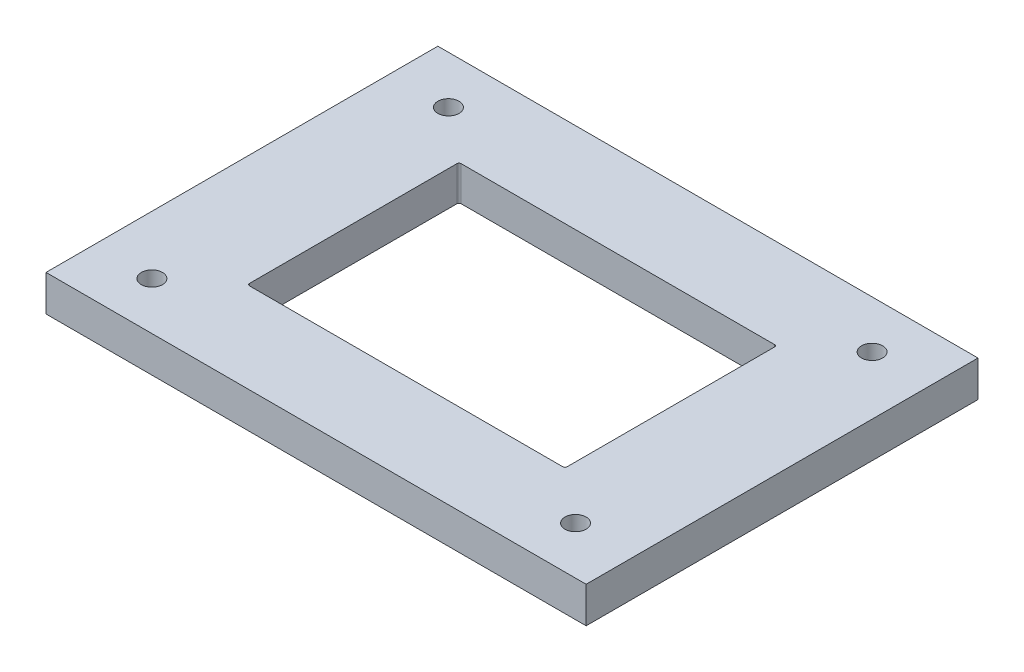
ISO-10303-21;
HEADER;
FILE_DESCRIPTION(('STEP AP214'),'2;1');
FILE_NAME('part.step','',(''),(''),'','','');
FILE_SCHEMA(('AUTOMOTIVE_DESIGN { 1 0 10303 214 1 1 1 1 }'));
ENDSEC;
DATA;
#1=APPLICATION_CONTEXT('core data for automotive mechanical design processes');
#2=APPLICATION_PROTOCOL_DEFINITION('international standard','automotive_design',2000,#1);
#3=PRODUCT_CONTEXT('',#1,'mechanical');
#4=PRODUCT('Part','Part','',(#3));
#5=PRODUCT_RELATED_PRODUCT_CATEGORY('part','',(#4));
#6=PRODUCT_DEFINITION_FORMATION('','',#4);
#7=PRODUCT_DEFINITION_CONTEXT('part definition',#1,'design');
#8=PRODUCT_DEFINITION('design','',#6,#7);
#9=PRODUCT_DEFINITION_SHAPE('','',#8);
#10=(LENGTH_UNIT() NAMED_UNIT(*) SI_UNIT(.MILLI.,.METRE.));
#11=(NAMED_UNIT(*) PLANE_ANGLE_UNIT() SI_UNIT($,.RADIAN.));
#12=(NAMED_UNIT(*) SI_UNIT($,.STERADIAN.) SOLID_ANGLE_UNIT());
#13=UNCERTAINTY_MEASURE_WITH_UNIT(LENGTH_MEASURE(1.E-05),#10,'distance_accuracy_value','');
#14=(GEOMETRIC_REPRESENTATION_CONTEXT(3) GLOBAL_UNCERTAINTY_ASSIGNED_CONTEXT((#13)) GLOBAL_UNIT_ASSIGNED_CONTEXT((#10,
#11,#12)) REPRESENTATION_CONTEXT('',''));
#15=CARTESIAN_POINT('',(0.,0.,0.));
#16=DIRECTION('',(0.,0.,1.));
#17=DIRECTION('',(1.,0.,0.));
#18=AXIS2_PLACEMENT_3D('',#15,#16,#17);
#19=CARTESIAN_POINT('',(-127.5,-17.,92.5));
#20=DIRECTION('',(-1.,0.,0.));
#21=DIRECTION('',(0.,0.,1.));
#22=AXIS2_PLACEMENT_3D('',#19,#20,#21);
#23=PLANE('',#22);
#24=DIRECTION('',(0.,0.,1.));
#25=VECTOR('',#24,1.);
#26=CARTESIAN_POINT('',(-127.5,0.,92.5));
#27=LINE('',#26,#25);
#28=CARTESIAN_POINT('',(-127.5,0.,-92.5));
#29=VERTEX_POINT('',#28);
#30=CARTESIAN_POINT('',(-127.5,0.,92.5));
#31=VERTEX_POINT('',#30);
#32=EDGE_CURVE('E158',#29,#31,#27,.T.);
#33=ORIENTED_EDGE('',*,*,#32,.F.);
#34=DIRECTION('',(0.,1.,0.));
#35=VECTOR('',#34,1.);
#36=CARTESIAN_POINT('',(-127.5,-17.,-92.5));
#37=LINE('',#36,#35);
#38=CARTESIAN_POINT('',(-127.5,-17.,-92.5));
#39=VERTEX_POINT('',#38);
#40=EDGE_CURVE('E146',#39,#29,#37,.T.);
#41=ORIENTED_EDGE('',*,*,#40,.F.);
#42=DIRECTION('',(0.,0.,1.));
#43=VECTOR('',#42,1.);
#44=CARTESIAN_POINT('',(-127.5,-17.,92.5));
#45=LINE('',#44,#43);
#46=CARTESIAN_POINT('',(-127.5,-17.,92.5));
#47=VERTEX_POINT('',#46);
#48=EDGE_CURVE('E141',#39,#47,#45,.T.);
#49=ORIENTED_EDGE('',*,*,#48,.T.);
#50=DIRECTION('',(0.,1.,0.));
#51=VECTOR('',#50,1.);
#52=CARTESIAN_POINT('',(-127.5,-17.,92.5));
#53=LINE('',#52,#51);
#54=EDGE_CURVE('E123',#47,#31,#53,.T.);
#55=ORIENTED_EDGE('',*,*,#54,.T.);
#56=EDGE_LOOP('',(#33,#41,#49,#55));
#57=FACE_BOUND('',#56,.T.);
#58=ADVANCED_FACE('F33',(#57),#23,.T.);
#59=CARTESIAN_POINT('',(127.5,-17.,-92.5));
#60=DIRECTION('',(0.,0.,-1.));
#61=DIRECTION('',(-1.,0.,0.));
#62=AXIS2_PLACEMENT_3D('',#59,#60,#61);
#63=PLANE('',#62);
#64=DIRECTION('',(-1.,0.,0.));
#65=VECTOR('',#64,1.);
#66=CARTESIAN_POINT('',(127.5,0.,-92.5));
#67=LINE('',#66,#65);
#68=CARTESIAN_POINT('',(127.5,0.,-92.5));
#69=VERTEX_POINT('',#68);
#70=EDGE_CURVE('E147',#69,#29,#67,.T.);
#71=ORIENTED_EDGE('',*,*,#70,.F.);
#72=DIRECTION('',(0.,1.,0.));
#73=VECTOR('',#72,1.);
#74=CARTESIAN_POINT('',(127.5,-17.,-92.5));
#75=LINE('',#74,#73);
#76=CARTESIAN_POINT('',(127.5,-17.,-92.5));
#77=VERTEX_POINT('',#76);
#78=EDGE_CURVE('E165',#77,#69,#75,.T.);
#79=ORIENTED_EDGE('',*,*,#78,.F.);
#80=DIRECTION('',(-1.,0.,0.));
#81=VECTOR('',#80,1.);
#82=CARTESIAN_POINT('',(127.5,-17.,-92.5));
#83=LINE('',#82,#81);
#84=EDGE_CURVE('E134',#77,#39,#83,.T.);
#85=ORIENTED_EDGE('',*,*,#84,.T.);
#86=ORIENTED_EDGE('',*,*,#40,.T.);
#87=EDGE_LOOP('',(#71,#79,#85,#86));
#88=FACE_BOUND('',#87,.T.);
#89=ADVANCED_FACE('F281',(#88),#63,.T.);
#90=CARTESIAN_POINT('',(127.5,-17.,92.5));
#91=DIRECTION('',(1.,0.,0.));
#92=DIRECTION('',(0.,0.,-1.));
#93=AXIS2_PLACEMENT_3D('',#90,#91,#92);
#94=PLANE('',#93);
#95=DIRECTION('',(0.,0.,-1.));
#96=VECTOR('',#95,1.);
#97=CARTESIAN_POINT('',(127.5,0.,92.5));
#98=LINE('',#97,#96);
#99=CARTESIAN_POINT('',(127.5,0.,92.5));
#100=VERTEX_POINT('',#99);
#101=EDGE_CURVE('E150',#100,#69,#98,.T.);
#102=ORIENTED_EDGE('',*,*,#101,.F.);
#103=DIRECTION('',(0.,1.,0.));
#104=VECTOR('',#103,1.);
#105=CARTESIAN_POINT('',(127.5,-17.,92.5));
#106=LINE('',#105,#104);
#107=CARTESIAN_POINT('',(127.5,-17.,92.5));
#108=VERTEX_POINT('',#107);
#109=EDGE_CURVE('E133',#108,#100,#106,.T.);
#110=ORIENTED_EDGE('',*,*,#109,.F.);
#111=DIRECTION('',(0.,0.,-1.));
#112=VECTOR('',#111,1.);
#113=CARTESIAN_POINT('',(127.5,-17.,92.5));
#114=LINE('',#113,#112);
#115=EDGE_CURVE('E144',#108,#77,#114,.T.);
#116=ORIENTED_EDGE('',*,*,#115,.T.);
#117=ORIENTED_EDGE('',*,*,#78,.T.);
#118=EDGE_LOOP('',(#102,#110,#116,#117));
#119=FACE_BOUND('',#118,.T.);
#120=ADVANCED_FACE('F276',(#119),#94,.T.);
#121=CARTESIAN_POINT('',(127.5,-17.,92.5));
#122=DIRECTION('',(0.,0.,1.));
#123=DIRECTION('',(1.,0.,0.));
#124=AXIS2_PLACEMENT_3D('',#121,#122,#123);
#125=PLANE('',#124);
#126=DIRECTION('',(1.,0.,0.));
#127=VECTOR('',#126,1.);
#128=CARTESIAN_POINT('',(127.5,0.,92.5));
#129=LINE('',#128,#127);
#130=EDGE_CURVE('E128',#31,#100,#129,.T.);
#131=ORIENTED_EDGE('',*,*,#130,.F.);
#132=ORIENTED_EDGE('',*,*,#54,.F.);
#133=DIRECTION('',(1.,0.,0.));
#134=VECTOR('',#133,1.);
#135=CARTESIAN_POINT('',(127.5,-17.,92.5));
#136=LINE('',#135,#134);
#137=EDGE_CURVE('E126',#47,#108,#136,.T.);
#138=ORIENTED_EDGE('',*,*,#137,.T.);
#139=ORIENTED_EDGE('',*,*,#109,.T.);
#140=EDGE_LOOP('',(#131,#132,#138,#139));
#141=FACE_BOUND('',#140,.T.);
#142=ADVANCED_FACE('F125',(#141),#125,.T.);
#143=CARTESIAN_POINT('',(0.,-17.,0.));
#144=DIRECTION('',(0.,1.,0.));
#145=DIRECTION('',(0.,0.,1.));
#146=AXIS2_PLACEMENT_3D('',#143,#144,#145);
#147=PLANE('',#146);
#148=CARTESIAN_POINT('',(-100.,-17.,70.));
#149=DIRECTION('',(0.,1.,0.));
#150=DIRECTION('',(0.,0.,1.));
#151=AXIS2_PLACEMENT_3D('',#148,#149,#150);
#152=CIRCLE('',#151,5.00000000000001);
#153=CARTESIAN_POINT('',(-100.,-17.,75.));
#154=VERTEX_POINT('',#153);
#155=EDGE_CURVE('E230',#154,#154,#152,.T.);
#156=ORIENTED_EDGE('',*,*,#155,.T.);
#157=EDGE_LOOP('',(#156));
#158=FACE_BOUND('',#157,.T.);
#159=CARTESIAN_POINT('',(100.,-17.,70.));
#160=DIRECTION('',(0.,1.,0.));
#161=DIRECTION('',(0.,0.,1.));
#162=AXIS2_PLACEMENT_3D('',#159,#160,#161);
#163=CIRCLE('',#162,5.00000000000001);
#164=CARTESIAN_POINT('',(100.,-17.,75.));
#165=VERTEX_POINT('',#164);
#166=EDGE_CURVE('E233',#165,#165,#163,.T.);
#167=ORIENTED_EDGE('',*,*,#166,.T.);
#168=EDGE_LOOP('',(#167));
#169=FACE_BOUND('',#168,.T.);
#170=CARTESIAN_POINT('',(100.,-17.,-70.));
#171=DIRECTION('',(0.,1.,0.));
#172=DIRECTION('',(0.,0.,1.));
#173=AXIS2_PLACEMENT_3D('',#170,#171,#172);
#174=CIRCLE('',#173,5.00000000000001);
#175=CARTESIAN_POINT('',(100.,-17.,-65.));
#176=VERTEX_POINT('',#175);
#177=EDGE_CURVE('E236',#176,#176,#174,.T.);
#178=ORIENTED_EDGE('',*,*,#177,.T.);
#179=EDGE_LOOP('',(#178));
#180=FACE_BOUND('',#179,.T.);
#181=CARTESIAN_POINT('',(-100.,-17.,-70.));
#182=DIRECTION('',(0.,1.,0.));
#183=DIRECTION('',(0.,0.,1.));
#184=AXIS2_PLACEMENT_3D('',#181,#182,#183);
#185=CIRCLE('',#184,5.00000000000001);
#186=CARTESIAN_POINT('',(-100.,-17.,-65.));
#187=VERTEX_POINT('',#186);
#188=EDGE_CURVE('E239',#187,#187,#185,.T.);
#189=ORIENTED_EDGE('',*,*,#188,.T.);
#190=EDGE_LOOP('',(#189));
#191=FACE_BOUND('',#190,.T.);
#192=DIRECTION('',(0.,0.,-1.));
#193=VECTOR('',#192,1.);
#194=CARTESIAN_POINT('',(75.5636530813597,-17.,0.));
#195=LINE('',#194,#193);
#196=CARTESIAN_POINT('',(75.5636530813597,-17.,49.5642622543406));
#197=VERTEX_POINT('',#196);
#198=CARTESIAN_POINT('',(75.5636530813597,-17.,-49.5642622543406));
#199=VERTEX_POINT('',#198);
#200=EDGE_CURVE('E219',#197,#199,#195,.T.);
#201=ORIENTED_EDGE('',*,*,#200,.T.);
#202=CARTESIAN_POINT('',(74.5630435370609,-17.,-49.5630435370609));
#203=DIRECTION('',(0.,1.,0.));
#204=DIRECTION('',(0.707106781186548,0.,-0.707106781186548));
#205=AXIS2_PLACEMENT_3D('',#202,#203,#204);
#206=ELLIPSE('',#205,1.00121871750572,1.);
#207=CARTESIAN_POINT('',(74.5642622543406,-17.,-50.5636530813597));
#208=VERTEX_POINT('',#207);
#209=EDGE_CURVE('E55',#199,#208,#206,.T.);
#210=ORIENTED_EDGE('',*,*,#209,.T.);
#211=DIRECTION('',(-1.,0.,0.));
#212=VECTOR('',#211,1.);
#213=CARTESIAN_POINT('',(0.,-17.,-50.5636530813597));
#214=LINE('',#213,#212);
#215=CARTESIAN_POINT('',(-74.5642622543406,-17.,-50.5636530813597));
#216=VERTEX_POINT('',#215);
#217=EDGE_CURVE('E215',#208,#216,#214,.T.);
#218=ORIENTED_EDGE('',*,*,#217,.T.);
#219=CARTESIAN_POINT('',(-74.5630435370609,-17.,-49.5630435370609));
#220=DIRECTION('',(0.,1.,0.));
#221=DIRECTION('',(-0.707106781186548,0.,-0.707106781186548));
#222=AXIS2_PLACEMENT_3D('',#219,#220,#221);
#223=ELLIPSE('',#222,1.00121871750572,1.);
#224=CARTESIAN_POINT('',(-75.5636530813597,-17.,-49.5642622543406));
#225=VERTEX_POINT('',#224);
#226=EDGE_CURVE('E11',#216,#225,#223,.T.);
#227=ORIENTED_EDGE('',*,*,#226,.T.);
#228=DIRECTION('',(0.,0.,1.));
#229=VECTOR('',#228,1.);
#230=CARTESIAN_POINT('',(-75.5636530813597,-17.,0.));
#231=LINE('',#230,#229);
#232=CARTESIAN_POINT('',(-75.5636530813597,-17.,49.5642622543406));
#233=VERTEX_POINT('',#232);
#234=EDGE_CURVE('E153',#225,#233,#231,.T.);
#235=ORIENTED_EDGE('',*,*,#234,.T.);
#236=CARTESIAN_POINT('',(-74.5630435370609,-17.,49.5630435370609));
#237=DIRECTION('',(0.,1.,0.));
#238=DIRECTION('',(-0.707106781186548,0.,0.707106781186548));
#239=AXIS2_PLACEMENT_3D('',#236,#237,#238);
#240=ELLIPSE('',#239,1.00121871750572,1.);
#241=CARTESIAN_POINT('',(-74.5642622543406,-17.,50.5636530813597));
#242=VERTEX_POINT('',#241);
#243=EDGE_CURVE('E192',#233,#242,#240,.T.);
#244=ORIENTED_EDGE('',*,*,#243,.T.);
#245=DIRECTION('',(1.,0.,0.));
#246=VECTOR('',#245,1.);
#247=CARTESIAN_POINT('',(0.,-17.,50.5636530813597));
#248=LINE('',#247,#246);
#249=CARTESIAN_POINT('',(74.5642622543406,-17.,50.5636530813597));
#250=VERTEX_POINT('',#249);
#251=EDGE_CURVE('E208',#242,#250,#248,.T.);
#252=ORIENTED_EDGE('',*,*,#251,.T.);
#253=CARTESIAN_POINT('',(74.5630435370609,-17.,49.5630435370609));
#254=DIRECTION('',(0.,1.,0.));
#255=DIRECTION('',(0.707106781186548,0.,0.707106781186548));
#256=AXIS2_PLACEMENT_3D('',#253,#254,#255);
#257=ELLIPSE('',#256,1.00121871750572,1.);
#258=EDGE_CURVE('E188',#250,#197,#257,.T.);
#259=ORIENTED_EDGE('',*,*,#258,.T.);
#260=EDGE_LOOP('',(#201,#210,#218,#227,#235,#244,#252,#259));
#261=FACE_BOUND('',#260,.T.);
#262=ORIENTED_EDGE('',*,*,#48,.F.);
#263=ORIENTED_EDGE('',*,*,#84,.F.);
#264=ORIENTED_EDGE('',*,*,#115,.F.);
#265=ORIENTED_EDGE('',*,*,#137,.F.);
#266=EDGE_LOOP('',(#262,#263,#264,#265));
#267=FACE_BOUND('',#266,.T.);
#268=ADVANCED_FACE('F139',(#158,#169,#180,#191,#261,#267),#147,.F.);
#269=CARTESIAN_POINT('',(0.,0.,0.));
#270=DIRECTION('',(0.,1.,0.));
#271=DIRECTION('',(0.,0.,1.));
#272=AXIS2_PLACEMENT_3D('',#269,#270,#271);
#273=PLANE('',#272);
#274=CARTESIAN_POINT('',(-100.,0.,70.));
#275=DIRECTION('',(0.,1.,0.));
#276=DIRECTION('',(0.,0.,-1.));
#277=AXIS2_PLACEMENT_3D('',#274,#275,#276);
#278=CIRCLE('',#277,5.00000000000001);
#279=CARTESIAN_POINT('',(-100.,0.,65.));
#280=VERTEX_POINT('',#279);
#281=EDGE_CURVE('E246',#280,#280,#278,.T.);
#282=ORIENTED_EDGE('',*,*,#281,.F.);
#283=EDGE_LOOP('',(#282));
#284=FACE_BOUND('',#283,.T.);
#285=CARTESIAN_POINT('',(100.,0.,70.));
#286=DIRECTION('',(0.,1.,0.));
#287=DIRECTION('',(0.,0.,1.));
#288=AXIS2_PLACEMENT_3D('',#285,#286,#287);
#289=CIRCLE('',#288,5.00000000000001);
#290=CARTESIAN_POINT('',(100.,0.,75.));
#291=VERTEX_POINT('',#290);
#292=EDGE_CURVE('E249',#291,#291,#289,.T.);
#293=ORIENTED_EDGE('',*,*,#292,.F.);
#294=EDGE_LOOP('',(#293));
#295=FACE_BOUND('',#294,.T.);
#296=CARTESIAN_POINT('',(100.,0.,-70.));
#297=DIRECTION('',(0.,1.,0.));
#298=DIRECTION('',(0.,0.,-1.));
#299=AXIS2_PLACEMENT_3D('',#296,#297,#298);
#300=CIRCLE('',#299,5.00000000000001);
#301=CARTESIAN_POINT('',(100.,0.,-75.));
#302=VERTEX_POINT('',#301);
#303=EDGE_CURVE('E245',#302,#302,#300,.T.);
#304=ORIENTED_EDGE('',*,*,#303,.F.);
#305=EDGE_LOOP('',(#304));
#306=FACE_BOUND('',#305,.T.);
#307=CARTESIAN_POINT('',(-100.,0.,-70.));
#308=DIRECTION('',(0.,1.,0.));
#309=DIRECTION('',(0.,0.,1.));
#310=AXIS2_PLACEMENT_3D('',#307,#308,#309);
#311=CIRCLE('',#310,5.00000000000001);
#312=CARTESIAN_POINT('',(-100.,0.,-65.));
#313=VERTEX_POINT('',#312);
#314=EDGE_CURVE('E242',#313,#313,#311,.T.);
#315=ORIENTED_EDGE('',*,*,#314,.F.);
#316=EDGE_LOOP('',(#315));
#317=FACE_BOUND('',#316,.T.);
#318=DIRECTION('',(0.,0.,1.));
#319=VECTOR('',#318,1.);
#320=CARTESIAN_POINT('',(-74.97,0.,49.97));
#321=LINE('',#320,#319);
#322=CARTESIAN_POINT('',(-74.97,0.,-48.9706091729809));
#323=VERTEX_POINT('',#322);
#324=CARTESIAN_POINT('',(-74.97,0.,48.9706091729809));
#325=VERTEX_POINT('',#324);
#326=EDGE_CURVE('E203',#323,#325,#321,.T.);
#327=ORIENTED_EDGE('',*,*,#326,.F.);
#328=CARTESIAN_POINT('',(-73.9693904557012,0.,-48.9693904557012));
#329=DIRECTION('',(0.,1.,0.));
#330=DIRECTION('',(-0.707106781186548,0.,-0.707106781186548));
#331=AXIS2_PLACEMENT_3D('',#328,#329,#330);
#332=ELLIPSE('',#331,1.00121871750572,1.);
#333=CARTESIAN_POINT('',(-73.9706091729809,0.,-49.97));
#334=VERTEX_POINT('',#333);
#335=EDGE_CURVE('E41',#323,#334,#332,.F.);
#336=ORIENTED_EDGE('',*,*,#335,.T.);
#337=DIRECTION('',(-1.,0.,0.));
#338=VECTOR('',#337,1.);
#339=CARTESIAN_POINT('',(74.97,0.,-49.97));
#340=LINE('',#339,#338);
#341=CARTESIAN_POINT('',(73.9706091729809,0.,-49.97));
#342=VERTEX_POINT('',#341);
#343=EDGE_CURVE('E201',#342,#334,#340,.T.);
#344=ORIENTED_EDGE('',*,*,#343,.F.);
#345=CARTESIAN_POINT('',(73.9693904557012,0.,-48.9693904557012));
#346=DIRECTION('',(0.,1.,0.));
#347=DIRECTION('',(0.707106781186548,0.,-0.707106781186548));
#348=AXIS2_PLACEMENT_3D('',#345,#346,#347);
#349=ELLIPSE('',#348,1.00121871750572,1.);
#350=CARTESIAN_POINT('',(74.97,0.,-48.9706091729809));
#351=VERTEX_POINT('',#350);
#352=EDGE_CURVE('E194',#342,#351,#349,.F.);
#353=ORIENTED_EDGE('',*,*,#352,.T.);
#354=DIRECTION('',(0.,0.,-1.));
#355=VECTOR('',#354,1.);
#356=CARTESIAN_POINT('',(74.97,0.,49.97));
#357=LINE('',#356,#355);
#358=CARTESIAN_POINT('',(74.97,0.,48.9706091729809));
#359=VERTEX_POINT('',#358);
#360=EDGE_CURVE('E209',#359,#351,#357,.T.);
#361=ORIENTED_EDGE('',*,*,#360,.F.);
#362=CARTESIAN_POINT('',(73.9693904557012,0.,48.9693904557012));
#363=DIRECTION('',(0.,1.,0.));
#364=DIRECTION('',(0.707106781186548,0.,0.707106781186548));
#365=AXIS2_PLACEMENT_3D('',#362,#363,#364);
#366=ELLIPSE('',#365,1.00121871750572,1.);
#367=CARTESIAN_POINT('',(73.9706091729809,0.,49.97));
#368=VERTEX_POINT('',#367);
#369=EDGE_CURVE('E186',#359,#368,#366,.F.);
#370=ORIENTED_EDGE('',*,*,#369,.T.);
#371=DIRECTION('',(1.,0.,0.));
#372=VECTOR('',#371,1.);
#373=CARTESIAN_POINT('',(74.97,0.,49.97));
#374=LINE('',#373,#372);
#375=CARTESIAN_POINT('',(-73.9706091729809,0.,49.97));
#376=VERTEX_POINT('',#375);
#377=EDGE_CURVE('E226',#376,#368,#374,.T.);
#378=ORIENTED_EDGE('',*,*,#377,.F.);
#379=CARTESIAN_POINT('',(-73.9693904557012,0.,48.9693904557012));
#380=DIRECTION('',(0.,1.,0.));
#381=DIRECTION('',(-0.707106781186548,0.,0.707106781186548));
#382=AXIS2_PLACEMENT_3D('',#379,#380,#381);
#383=ELLIPSE('',#382,1.00121871750572,1.);
#384=EDGE_CURVE('E190',#376,#325,#383,.F.);
#385=ORIENTED_EDGE('',*,*,#384,.T.);
#386=EDGE_LOOP('',(#327,#336,#344,#353,#361,#370,#378,#385));
#387=FACE_BOUND('',#386,.T.);
#388=ORIENTED_EDGE('',*,*,#32,.T.);
#389=ORIENTED_EDGE('',*,*,#130,.T.);
#390=ORIENTED_EDGE('',*,*,#101,.T.);
#391=ORIENTED_EDGE('',*,*,#70,.T.);
#392=EDGE_LOOP('',(#388,#389,#390,#391));
#393=FACE_BOUND('',#392,.T.);
#394=ADVANCED_FACE('F199',(#284,#295,#306,#317,#387,#393),#273,.T.);
#395=CARTESIAN_POINT('',(-74.97,0.,49.97));
#396=DIRECTION('',(-0.999390827019096,0.034899496702501,0.));
#397=DIRECTION('',(-0.034899496702501,-0.999390827019096,0.));
#398=AXIS2_PLACEMENT_3D('',#395,#396,#397);
#399=PLANE('',#398);
#400=ORIENTED_EDGE('',*,*,#326,.T.);
#401=DIRECTION('',(0.0348782627423747,0.998782765958718,-0.0348782627423747));
#402=VECTOR('',#401,1.);
#403=CARTESIAN_POINT('',(-75.5648688335168,-17.0348145867008,49.5654780064978));
#404=LINE('',#403,#402);
#405=EDGE_CURVE('E180',#325,#233,#404,.F.);
#406=ORIENTED_EDGE('',*,*,#405,.T.);
#407=ORIENTED_EDGE('',*,*,#234,.F.);
#408=DIRECTION('',(0.0348782627423747,0.998782765958718,0.0348782627423747));
#409=VECTOR('',#408,1.);
#410=CARTESIAN_POINT('',(-74.9712157521571,-0.0348145867008237,-48.971824925138));
#411=LINE('',#410,#409);
#412=EDGE_CURVE('E177',#225,#323,#411,.T.);
#413=ORIENTED_EDGE('',*,*,#412,.T.);
#414=EDGE_LOOP('',(#400,#406,#407,#413));
#415=FACE_BOUND('',#414,.T.);
#416=ADVANCED_FACE('F217',(#415),#399,.F.);
#417=CARTESIAN_POINT('',(74.97,0.,-49.97));
#418=DIRECTION('',(0.,0.034899496702501,-0.999390827019096));
#419=DIRECTION('',(0.,0.999390827019096,0.034899496702501));
#420=AXIS2_PLACEMENT_3D('',#417,#418,#419);
#421=PLANE('',#420);
#422=ORIENTED_EDGE('',*,*,#217,.F.);
#423=DIRECTION('',(-0.0348782627423747,0.998782765958718,0.0348782627423747));
#424=VECTOR('',#423,1.);
#425=CARTESIAN_POINT('',(73.971824925138,-0.0348145867008247,-49.9712157521571));
#426=LINE('',#425,#424);
#427=EDGE_CURVE('E183',#208,#342,#426,.T.);
#428=ORIENTED_EDGE('',*,*,#427,.T.);
#429=ORIENTED_EDGE('',*,*,#343,.T.);
#430=DIRECTION('',(0.0348782627423747,0.998782765958718,0.0348782627423747));
#431=VECTOR('',#430,1.);
#432=CARTESIAN_POINT('',(-74.5654780064977,-17.0348145867008,-50.5648688335168));
#433=LINE('',#432,#431);
#434=EDGE_CURVE('E48',#334,#216,#433,.F.);
#435=ORIENTED_EDGE('',*,*,#434,.T.);
#436=EDGE_LOOP('',(#422,#428,#429,#435));
#437=FACE_BOUND('',#436,.T.);
#438=ADVANCED_FACE('F206',(#437),#421,.F.);
#439=CARTESIAN_POINT('',(74.97,0.,49.97));
#440=DIRECTION('',(0.999390827019096,0.034899496702501,0.));
#441=DIRECTION('',(-0.034899496702501,0.999390827019096,0.));
#442=AXIS2_PLACEMENT_3D('',#439,#440,#441);
#443=PLANE('',#442);
#444=ORIENTED_EDGE('',*,*,#200,.F.);
#445=DIRECTION('',(-0.0348782627423747,0.998782765958718,-0.0348782627423747));
#446=VECTOR('',#445,1.);
#447=CARTESIAN_POINT('',(74.9712157521571,-0.0348145867008247,48.971824925138));
#448=LINE('',#447,#446);
#449=EDGE_CURVE('E169',#197,#359,#448,.T.);
#450=ORIENTED_EDGE('',*,*,#449,.T.);
#451=ORIENTED_EDGE('',*,*,#360,.T.);
#452=DIRECTION('',(-0.0348782627423747,0.998782765958718,0.0348782627423747));
#453=VECTOR('',#452,1.);
#454=CARTESIAN_POINT('',(75.5648688335168,-17.0348145867008,-49.5654780064977));
#455=LINE('',#454,#453);
#456=EDGE_CURVE('E164',#351,#199,#455,.F.);
#457=ORIENTED_EDGE('',*,*,#456,.T.);
#458=EDGE_LOOP('',(#444,#450,#451,#457));
#459=FACE_BOUND('',#458,.T.);
#460=ADVANCED_FACE('F308',(#459),#443,.F.);
#461=CARTESIAN_POINT('',(74.97,0.,49.97));
#462=DIRECTION('',(0.,0.034899496702501,0.999390827019096));
#463=DIRECTION('',(0.,-0.999390827019096,0.034899496702501));
#464=AXIS2_PLACEMENT_3D('',#461,#462,#463);
#465=PLANE('',#464);
#466=ORIENTED_EDGE('',*,*,#377,.T.);
#467=DIRECTION('',(-0.0348782627423747,0.998782765958718,-0.0348782627423747));
#468=VECTOR('',#467,1.);
#469=CARTESIAN_POINT('',(74.5654780064977,-17.0348145867008,50.5648688335168));
#470=LINE('',#469,#468);
#471=EDGE_CURVE('E175',#368,#250,#470,.F.);
#472=ORIENTED_EDGE('',*,*,#471,.T.);
#473=ORIENTED_EDGE('',*,*,#251,.F.);
#474=DIRECTION('',(0.0348782627423747,0.998782765958718,-0.0348782627423747));
#475=VECTOR('',#474,1.);
#476=CARTESIAN_POINT('',(-73.971824925138,-0.0348145867008233,49.9712157521571));
#477=LINE('',#476,#475);
#478=EDGE_CURVE('E172',#242,#376,#477,.T.);
#479=ORIENTED_EDGE('',*,*,#478,.T.);
#480=EDGE_LOOP('',(#466,#472,#473,#479));
#481=FACE_BOUND('',#480,.T.);
#482=ADVANCED_FACE('F294',(#481),#465,.F.);
#483=CARTESIAN_POINT('',(73.971824925138,-0.0697140834033256,48.971824925138));
#484=DIRECTION('',(0.0348782627423747,-0.998782765958718,0.0348782627423747));
#485=DIRECTION('',(0.,-0.034899496702501,-0.999390827019096));
#486=AXIS2_PLACEMENT_3D('',#483,#484,#485);
#487=CYLINDRICAL_SURFACE('',#486,1.);
#488=ORIENTED_EDGE('',*,*,#258,.F.);
#489=ORIENTED_EDGE('',*,*,#471,.F.);
#490=ORIENTED_EDGE('',*,*,#369,.F.);
#491=ORIENTED_EDGE('',*,*,#449,.F.);
#492=EDGE_LOOP('',(#488,#489,#490,#491));
#493=FACE_BOUND('',#492,.T.);
#494=ADVANCED_FACE('F290',(#493),#487,.F.);
#495=CARTESIAN_POINT('',(-73.7894239329418,5.15356692818224,48.7894239329418));
#496=DIRECTION('',(-0.0348782627423747,-0.998782765958718,0.0348782627423747));
#497=DIRECTION('',(0.,-0.034899496702501,-0.999390827019096));
#498=AXIS2_PLACEMENT_3D('',#495,#496,#497);
#499=CYLINDRICAL_SURFACE('',#498,1.);
#500=ORIENTED_EDGE('',*,*,#243,.F.);
#501=ORIENTED_EDGE('',*,*,#405,.F.);
#502=ORIENTED_EDGE('',*,*,#384,.F.);
#503=ORIENTED_EDGE('',*,*,#478,.F.);
#504=EDGE_LOOP('',(#500,#501,#502,#503));
#505=FACE_BOUND('',#504,.T.);
#506=ADVANCED_FACE('F293',(#505),#499,.F.);
#507=CARTESIAN_POINT('',(73.971824925138,-0.0697140834033256,-48.971824925138));
#508=DIRECTION('',(0.0348782627423747,-0.998782765958718,-0.0348782627423747));
#509=DIRECTION('',(0.,0.034899496702501,-0.999390827019096));
#510=AXIS2_PLACEMENT_3D('',#507,#508,#509);
#511=CYLINDRICAL_SURFACE('',#510,1.);
#512=ORIENTED_EDGE('',*,*,#209,.F.);
#513=ORIENTED_EDGE('',*,*,#456,.F.);
#514=ORIENTED_EDGE('',*,*,#352,.F.);
#515=ORIENTED_EDGE('',*,*,#427,.F.);
#516=EDGE_LOOP('',(#512,#513,#514,#515));
#517=FACE_BOUND('',#516,.T.);
#518=ADVANCED_FACE('F297',(#517),#511,.F.);
#519=CARTESIAN_POINT('',(-73.8502485935381,3.41177654149905,-48.8502485935381));
#520=DIRECTION('',(-0.0348782627423747,-0.998782765958718,-0.0348782627423747));
#521=DIRECTION('',(0.,0.034899496702501,-0.999390827019096));
#522=AXIS2_PLACEMENT_3D('',#519,#520,#521);
#523=CYLINDRICAL_SURFACE('',#522,1.);
#524=ORIENTED_EDGE('',*,*,#226,.F.);
#525=ORIENTED_EDGE('',*,*,#434,.F.);
#526=ORIENTED_EDGE('',*,*,#335,.F.);
#527=ORIENTED_EDGE('',*,*,#412,.F.);
#528=EDGE_LOOP('',(#524,#525,#526,#527));
#529=FACE_BOUND('',#528,.T.);
#530=ADVANCED_FACE('F35',(#529),#523,.F.);
#531=CARTESIAN_POINT('',(-100.,-19.5,-70.));
#532=DIRECTION('',(0.,1.,0.));
#533=DIRECTION('',(0.,0.,1.));
#534=AXIS2_PLACEMENT_3D('',#531,#532,#533);
#535=CYLINDRICAL_SURFACE('',#534,5.00000000000001);
#536=ORIENTED_EDGE('',*,*,#314,.T.);
#537=EDGE_LOOP('',(#536));
#538=FACE_BOUND('',#537,.T.);
#539=ORIENTED_EDGE('',*,*,#188,.F.);
#540=EDGE_LOOP('',(#539));
#541=FACE_BOUND('',#540,.T.);
#542=ADVANCED_FACE('F264',(#538,#541),#535,.F.);
#543=CARTESIAN_POINT('',(100.,-19.5,-70.));
#544=DIRECTION('',(0.,1.,0.));
#545=DIRECTION('',(0.,0.,1.));
#546=AXIS2_PLACEMENT_3D('',#543,#544,#545);
#547=CYLINDRICAL_SURFACE('',#546,5.00000000000001);
#548=ORIENTED_EDGE('',*,*,#303,.T.);
#549=EDGE_LOOP('',(#548));
#550=FACE_BOUND('',#549,.T.);
#551=ORIENTED_EDGE('',*,*,#177,.F.);
#552=EDGE_LOOP('',(#551));
#553=FACE_BOUND('',#552,.T.);
#554=ADVANCED_FACE('F255',(#550,#553),#547,.F.);
#555=CARTESIAN_POINT('',(100.,-19.5,70.));
#556=DIRECTION('',(0.,1.,0.));
#557=DIRECTION('',(0.,0.,1.));
#558=AXIS2_PLACEMENT_3D('',#555,#556,#557);
#559=CYLINDRICAL_SURFACE('',#558,5.00000000000001);
#560=ORIENTED_EDGE('',*,*,#292,.T.);
#561=EDGE_LOOP('',(#560));
#562=FACE_BOUND('',#561,.T.);
#563=ORIENTED_EDGE('',*,*,#166,.F.);
#564=EDGE_LOOP('',(#563));
#565=FACE_BOUND('',#564,.T.);
#566=ADVANCED_FACE('F353',(#562,#565),#559,.F.);
#567=CARTESIAN_POINT('',(-100.,-19.5,70.));
#568=DIRECTION('',(0.,1.,0.));
#569=DIRECTION('',(0.,0.,1.));
#570=AXIS2_PLACEMENT_3D('',#567,#568,#569);
#571=CYLINDRICAL_SURFACE('',#570,5.00000000000001);
#572=ORIENTED_EDGE('',*,*,#281,.T.);
#573=EDGE_LOOP('',(#572));
#574=FACE_BOUND('',#573,.T.);
#575=ORIENTED_EDGE('',*,*,#155,.F.);
#576=EDGE_LOOP('',(#575));
#577=FACE_BOUND('',#576,.T.);
#578=ADVANCED_FACE('F362',(#574,#577),#571,.F.);
#579=CLOSED_SHELL('',(#58,#89,#120,#142,#268,#394,#416,#438,#460,#482,#494,#506,#518,#530,#542,
#554,#566,#578));
#580=MANIFOLD_SOLID_BREP('B2',#579);
#581=ADVANCED_BREP_SHAPE_REPRESENTATION('',(#18,#580),#14);
#582=SHAPE_DEFINITION_REPRESENTATION(#9,#581);
ENDSEC;
END-ISO-10303-21;
